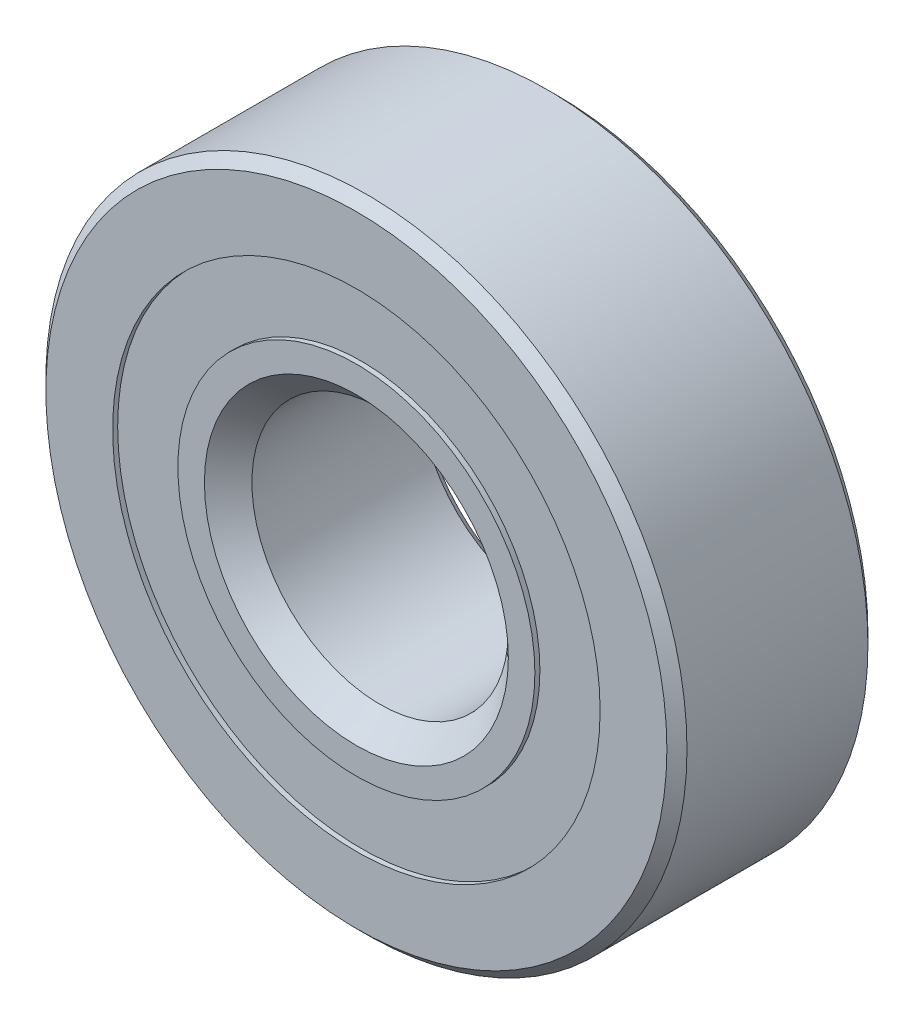
ISO-10303-21;
HEADER;
FILE_DESCRIPTION(('STEP AP214'),'2;1');
FILE_NAME('part.step','',(''),(''),'','','');
FILE_SCHEMA(('AUTOMOTIVE_DESIGN { 1 0 10303 214 1 1 1 1 }'));
ENDSEC;
DATA;
#1=APPLICATION_CONTEXT('core data for automotive mechanical design processes');
#2=APPLICATION_PROTOCOL_DEFINITION('international standard','automotive_design',2000,#1);
#3=PRODUCT_CONTEXT('',#1,'mechanical');
#4=PRODUCT('Part','Part','',(#3));
#5=PRODUCT_RELATED_PRODUCT_CATEGORY('part','',(#4));
#6=PRODUCT_DEFINITION_FORMATION('','',#4);
#7=PRODUCT_DEFINITION_CONTEXT('part definition',#1,'design');
#8=PRODUCT_DEFINITION('design','',#6,#7);
#9=PRODUCT_DEFINITION_SHAPE('','',#8);
#10=(LENGTH_UNIT() NAMED_UNIT(*) SI_UNIT(.MILLI.,.METRE.));
#11=(NAMED_UNIT(*) PLANE_ANGLE_UNIT() SI_UNIT($,.RADIAN.));
#12=(NAMED_UNIT(*) SI_UNIT($,.STERADIAN.) SOLID_ANGLE_UNIT());
#13=UNCERTAINTY_MEASURE_WITH_UNIT(LENGTH_MEASURE(1.E-05),#10,'distance_accuracy_value','');
#14=(GEOMETRIC_REPRESENTATION_CONTEXT(3) GLOBAL_UNCERTAINTY_ASSIGNED_CONTEXT((#13)) GLOBAL_UNIT_ASSIGNED_CONTEXT((#10,
#11,#12)) REPRESENTATION_CONTEXT('',''));
#15=CARTESIAN_POINT('',(0.,0.,0.));
#16=DIRECTION('',(0.,0.,1.));
#17=DIRECTION('',(1.,0.,0.));
#18=AXIS2_PLACEMENT_3D('',#15,#16,#17);
#19=CARTESIAN_POINT('',(0.,0.,2.4892));
#20=DIRECTION('',(0.,0.,1.));
#21=DIRECTION('',(1.,0.,0.));
#22=AXIS2_PLACEMENT_3D('',#19,#20,#21);
#23=CYLINDRICAL_SURFACE('',#22,6.03522142857143);
#24=CARTESIAN_POINT('',(0.,0.,2.4892));
#25=DIRECTION('',(0.,0.,1.));
#26=DIRECTION('',(1.,0.,0.));
#27=AXIS2_PLACEMENT_3D('',#24,#25,#26);
#28=CIRCLE('',#27,6.03522142857143);
#29=CARTESIAN_POINT('',(6.03522142857143,0.,2.4892));
#30=VERTEX_POINT('',#29);
#31=EDGE_CURVE('E151',#30,#30,#28,.T.);
#32=ORIENTED_EDGE('',*,*,#31,.T.);
#33=EDGE_LOOP('',(#32));
#34=FACE_BOUND('',#33,.T.);
#35=CARTESIAN_POINT('',(0.,0.,2.36474));
#36=DIRECTION('',(0.,0.,-1.));
#37=DIRECTION('',(-1.,0.,0.));
#38=AXIS2_PLACEMENT_3D('',#35,#36,#37);
#39=CIRCLE('',#38,6.03522142857143);
#40=CARTESIAN_POINT('',(-6.03522142857143,0.,2.36474));
#41=VERTEX_POINT('',#40);
#42=EDGE_CURVE('E45',#41,#41,#39,.T.);
#43=ORIENTED_EDGE('',*,*,#42,.T.);
#44=EDGE_LOOP('',(#43));
#45=FACE_BOUND('',#44,.T.);
#46=ADVANCED_FACE('F36',(#34,#45),#23,.F.);
#47=CARTESIAN_POINT('',(0.,6.14789916477321,-2.36474));
#48=DIRECTION('',(0.,0.,1.));
#49=DIRECTION('',(1.,0.,0.));
#50=AXIS2_PLACEMENT_3D('',#47,#48,#49);
#51=PLANE('',#50);
#52=CARTESIAN_POINT('',(0.,0.,-2.36474));
#53=DIRECTION('',(0.,0.,1.));
#54=DIRECTION('',(1.,0.,0.));
#55=AXIS2_PLACEMENT_3D('',#52,#53,#54);
#56=CIRCLE('',#55,5.07727857142857);
#57=CARTESIAN_POINT('',(5.07727857142857,0.,-2.36474));
#58=VERTEX_POINT('',#57);
#59=EDGE_CURVE('E58',#58,#58,#56,.T.);
#60=ORIENTED_EDGE('',*,*,#59,.T.);
#61=EDGE_LOOP('',(#60));
#62=FACE_BOUND('',#61,.T.);
#63=CARTESIAN_POINT('',(0.,0.,-2.36474));
#64=DIRECTION('',(0.,0.,1.));
#65=DIRECTION('',(1.,0.,0.));
#66=AXIS2_PLACEMENT_3D('',#63,#64,#65);
#67=CIRCLE('',#66,6.03522142857143);
#68=CARTESIAN_POINT('',(6.03522142857143,0.,-2.36474));
#69=VERTEX_POINT('',#68);
#70=EDGE_CURVE('E63',#69,#69,#67,.T.);
#71=ORIENTED_EDGE('',*,*,#70,.F.);
#72=EDGE_LOOP('',(#71));
#73=FACE_BOUND('',#72,.T.);
#74=ADVANCED_FACE('F123',(#62,#73),#51,.F.);
#75=CARTESIAN_POINT('',(0.,0.,2.4892));
#76=DIRECTION('',(0.,0.,1.));
#77=DIRECTION('',(1.,0.,0.));
#78=AXIS2_PLACEMENT_3D('',#75,#76,#77);
#79=CYLINDRICAL_SURFACE('',#78,5.07727857142857);
#80=CARTESIAN_POINT('',(0.,0.,-2.4892));
#81=DIRECTION('',(0.,0.,1.));
#82=DIRECTION('',(1.,0.,0.));
#83=AXIS2_PLACEMENT_3D('',#80,#81,#82);
#84=CIRCLE('',#83,5.07727857142857);
#85=CARTESIAN_POINT('',(5.07727857142857,0.,-2.4892));
#86=VERTEX_POINT('',#85);
#87=EDGE_CURVE('E188',#86,#86,#84,.T.);
#88=ORIENTED_EDGE('',*,*,#87,.T.);
#89=EDGE_LOOP('',(#88));
#90=FACE_BOUND('',#89,.T.);
#91=ORIENTED_EDGE('',*,*,#59,.F.);
#92=EDGE_LOOP('',(#91));
#93=FACE_BOUND('',#92,.T.);
#94=ADVANCED_FACE('F103',(#90,#93),#79,.T.);
#95=CARTESIAN_POINT('',(0.,0.,2.4892));
#96=DIRECTION('',(0.,0.,1.));
#97=DIRECTION('',(1.,0.,0.));
#98=AXIS2_PLACEMENT_3D('',#95,#96,#97);
#99=CYLINDRICAL_SURFACE('',#98,4.42006562313009);
#100=CARTESIAN_POINT('',(0.,0.,2.4892));
#101=DIRECTION('',(0.,0.,1.));
#102=DIRECTION('',(1.,0.,0.));
#103=AXIS2_PLACEMENT_3D('',#100,#101,#102);
#104=CIRCLE('',#103,4.42006562313009);
#105=CARTESIAN_POINT('',(4.42006562313009,0.,2.4892));
#106=VERTEX_POINT('',#105);
#107=EDGE_CURVE('E171',#106,#106,#104,.T.);
#108=ORIENTED_EDGE('',*,*,#107,.F.);
#109=EDGE_LOOP('',(#108));
#110=FACE_BOUND('',#109,.T.);
#111=CARTESIAN_POINT('',(0.,0.,2.36474));
#112=DIRECTION('',(0.,0.,1.));
#113=DIRECTION('',(1.,0.,0.));
#114=AXIS2_PLACEMENT_3D('',#111,#112,#113);
#115=CIRCLE('',#114,4.42006562313009);
#116=CARTESIAN_POINT('',(4.42006562313009,0.,2.36474));
#117=VERTEX_POINT('',#116);
#118=EDGE_CURVE('E10',#117,#117,#115,.T.);
#119=ORIENTED_EDGE('',*,*,#118,.T.);
#120=EDGE_LOOP('',(#119));
#121=FACE_BOUND('',#120,.T.);
#122=ADVANCED_FACE('F113',(#110,#121),#99,.T.);
#123=CARTESIAN_POINT('',(0.,3.42392,-2.4892));
#124=DIRECTION('',(0.,0.,1.));
#125=DIRECTION('',(1.,0.,0.));
#126=AXIS2_PLACEMENT_3D('',#123,#124,#125);
#127=PLANE('',#126);
#128=ORIENTED_EDGE('',*,*,#87,.F.);
#129=EDGE_LOOP('',(#128));
#130=FACE_BOUND('',#129,.T.);
#131=CARTESIAN_POINT('',(0.,0.,-2.4892));
#132=DIRECTION('',(0.,0.,1.));
#133=DIRECTION('',(1.,0.,0.));
#134=AXIS2_PLACEMENT_3D('',#131,#132,#133);
#135=CIRCLE('',#134,3.42392);
#136=CARTESIAN_POINT('',(3.42392,0.,-2.4892));
#137=VERTEX_POINT('',#136);
#138=EDGE_CURVE('E185',#137,#137,#135,.T.);
#139=ORIENTED_EDGE('',*,*,#138,.T.);
#140=EDGE_LOOP('',(#139));
#141=FACE_BOUND('',#140,.T.);
#142=ADVANCED_FACE('F115',(#130,#141),#127,.F.);
#143=CARTESIAN_POINT('',(0.,0.,-2.24028));
#144=DIRECTION('',(0.,0.,-1.));
#145=DIRECTION('',(-1.,0.,0.));
#146=AXIS2_PLACEMENT_3D('',#143,#144,#145);
#147=CONICAL_SURFACE('',#146,3.175,0.785398163397448);
#148=ORIENTED_EDGE('',*,*,#138,.F.);
#149=EDGE_LOOP('',(#148));
#150=FACE_BOUND('',#149,.T.);
#151=CARTESIAN_POINT('',(0.,0.,-2.24028));
#152=DIRECTION('',(0.,0.,1.));
#153=DIRECTION('',(1.,0.,0.));
#154=AXIS2_PLACEMENT_3D('',#151,#152,#153);
#155=CIRCLE('',#154,3.175);
#156=CARTESIAN_POINT('',(3.175,0.,-2.24028));
#157=VERTEX_POINT('',#156);
#158=EDGE_CURVE('E182',#157,#157,#155,.T.);
#159=ORIENTED_EDGE('',*,*,#158,.T.);
#160=EDGE_LOOP('',(#159));
#161=FACE_BOUND('',#160,.T.);
#162=ADVANCED_FACE('F121',(#150,#161),#147,.F.);
#163=CARTESIAN_POINT('',(0.,0.,2.4892));
#164=DIRECTION('',(0.,0.,1.));
#165=DIRECTION('',(1.,0.,0.));
#166=AXIS2_PLACEMENT_3D('',#163,#164,#165);
#167=CYLINDRICAL_SURFACE('',#166,3.175);
#168=ORIENTED_EDGE('',*,*,#158,.F.);
#169=EDGE_LOOP('',(#168));
#170=FACE_BOUND('',#169,.T.);
#171=CARTESIAN_POINT('',(0.,0.,1.9013473251684));
#172=DIRECTION('',(0.,0.,1.));
#173=DIRECTION('',(1.,0.,0.));
#174=AXIS2_PLACEMENT_3D('',#171,#172,#173);
#175=CIRCLE('',#174,3.175);
#176=CARTESIAN_POINT('',(3.175,0.,1.9013473251684));
#177=VERTEX_POINT('',#176);
#178=EDGE_CURVE('E179',#177,#177,#175,.T.);
#179=ORIENTED_EDGE('',*,*,#178,.T.);
#180=EDGE_LOOP('',(#179));
#181=FACE_BOUND('',#180,.T.);
#182=ADVANCED_FACE('F260',(#170,#181),#167,.F.);
#183=CARTESIAN_POINT('',(0.,0.,2.4892));
#184=DIRECTION('',(0.,0.,1.));
#185=DIRECTION('',(1.,0.,0.));
#186=AXIS2_PLACEMENT_3D('',#183,#184,#185);
#187=CONICAL_SURFACE('',#186,3.7628526748316,0.785398163397449);
#188=ORIENTED_EDGE('',*,*,#178,.F.);
#189=EDGE_LOOP('',(#188));
#190=FACE_BOUND('',#189,.T.);
#191=CARTESIAN_POINT('',(0.,0.,2.4892));
#192=DIRECTION('',(0.,0.,1.));
#193=DIRECTION('',(1.,0.,0.));
#194=AXIS2_PLACEMENT_3D('',#191,#192,#193);
#195=CIRCLE('',#194,3.7628526748316);
#196=CARTESIAN_POINT('',(3.7628526748316,0.,2.4892));
#197=VERTEX_POINT('',#196);
#198=EDGE_CURVE('E176',#197,#197,#195,.T.);
#199=ORIENTED_EDGE('',*,*,#198,.T.);
#200=EDGE_LOOP('',(#199));
#201=FACE_BOUND('',#200,.T.);
#202=ADVANCED_FACE('F233',(#190,#201),#187,.F.);
#203=CARTESIAN_POINT('',(0.,4.42006562313009,2.4892));
#204=DIRECTION('',(0.,0.,-1.));
#205=DIRECTION('',(-1.,0.,0.));
#206=AXIS2_PLACEMENT_3D('',#203,#204,#205);
#207=PLANE('',#206);
#208=ORIENTED_EDGE('',*,*,#198,.F.);
#209=EDGE_LOOP('',(#208));
#210=FACE_BOUND('',#209,.T.);
#211=ORIENTED_EDGE('',*,*,#107,.T.);
#212=EDGE_LOOP('',(#211));
#213=FACE_BOUND('',#212,.T.);
#214=ADVANCED_FACE('F224',(#210,#213),#207,.F.);
#215=CARTESIAN_POINT('',(0.,0.,2.4892));
#216=DIRECTION('',(0.,0.,1.));
#217=DIRECTION('',(1.,0.,0.));
#218=AXIS2_PLACEMENT_3D('',#215,#216,#217);
#219=CYLINDRICAL_SURFACE('',#218,6.03522142857143);
#220=CARTESIAN_POINT('',(0.,0.,-2.4892));
#221=DIRECTION('',(0.,0.,1.));
#222=DIRECTION('',(1.,0.,0.));
#223=AXIS2_PLACEMENT_3D('',#220,#221,#222);
#224=CIRCLE('',#223,6.03522142857143);
#225=CARTESIAN_POINT('',(6.03522142857143,0.,-2.4892));
#226=VERTEX_POINT('',#225);
#227=EDGE_CURVE('E154',#226,#226,#224,.T.);
#228=ORIENTED_EDGE('',*,*,#227,.F.);
#229=EDGE_LOOP('',(#228));
#230=FACE_BOUND('',#229,.T.);
#231=ORIENTED_EDGE('',*,*,#70,.T.);
#232=EDGE_LOOP('',(#231));
#233=FACE_BOUND('',#232,.T.);
#234=ADVANCED_FACE('F218',(#230,#233),#219,.F.);
#235=CARTESIAN_POINT('',(0.,0.,2.24028));
#236=DIRECTION('',(0.,0.,-1.));
#237=DIRECTION('',(-1.,0.,0.));
#238=AXIS2_PLACEMENT_3D('',#235,#236,#237);
#239=CONICAL_SURFACE('',#238,7.9375,0.785398163397447);
#240=CARTESIAN_POINT('',(0.,0.,2.4892));
#241=DIRECTION('',(0.,0.,1.));
#242=DIRECTION('',(1.,0.,0.));
#243=AXIS2_PLACEMENT_3D('',#240,#241,#242);
#244=CIRCLE('',#243,7.68858);
#245=CARTESIAN_POINT('',(7.68858,0.,2.4892));
#246=VERTEX_POINT('',#245);
#247=EDGE_CURVE('E156',#246,#246,#244,.T.);
#248=ORIENTED_EDGE('',*,*,#247,.F.);
#249=EDGE_LOOP('',(#248));
#250=FACE_BOUND('',#249,.T.);
#251=CARTESIAN_POINT('',(0.,0.,2.24028));
#252=DIRECTION('',(0.,0.,1.));
#253=DIRECTION('',(1.,0.,0.));
#254=AXIS2_PLACEMENT_3D('',#251,#252,#253);
#255=CIRCLE('',#254,7.9375);
#256=CARTESIAN_POINT('',(7.9375,0.,2.24028));
#257=VERTEX_POINT('',#256);
#258=EDGE_CURVE('E168',#257,#257,#255,.T.);
#259=ORIENTED_EDGE('',*,*,#258,.T.);
#260=EDGE_LOOP('',(#259));
#261=FACE_BOUND('',#260,.T.);
#262=ADVANCED_FACE('F223',(#250,#261),#239,.T.);
#263=CARTESIAN_POINT('',(0.,0.,2.4892));
#264=DIRECTION('',(0.,0.,1.));
#265=DIRECTION('',(1.,0.,0.));
#266=AXIS2_PLACEMENT_3D('',#263,#264,#265);
#267=CYLINDRICAL_SURFACE('',#266,7.9375);
#268=ORIENTED_EDGE('',*,*,#258,.F.);
#269=EDGE_LOOP('',(#268));
#270=FACE_BOUND('',#269,.T.);
#271=CARTESIAN_POINT('',(0.,0.,-2.24028));
#272=DIRECTION('',(0.,0.,1.));
#273=DIRECTION('',(1.,0.,0.));
#274=AXIS2_PLACEMENT_3D('',#271,#272,#273);
#275=CIRCLE('',#274,7.9375);
#276=CARTESIAN_POINT('',(7.9375,0.,-2.24028));
#277=VERTEX_POINT('',#276);
#278=EDGE_CURVE('E165',#277,#277,#275,.T.);
#279=ORIENTED_EDGE('',*,*,#278,.T.);
#280=EDGE_LOOP('',(#279));
#281=FACE_BOUND('',#280,.T.);
#282=ADVANCED_FACE('F230',(#270,#281),#267,.T.);
#283=CARTESIAN_POINT('',(0.,0.,-2.4892));
#284=DIRECTION('',(0.,0.,1.));
#285=DIRECTION('',(1.,0.,0.));
#286=AXIS2_PLACEMENT_3D('',#283,#284,#285);
#287=CONICAL_SURFACE('',#286,7.68858,0.785398163397447);
#288=ORIENTED_EDGE('',*,*,#278,.F.);
#289=EDGE_LOOP('',(#288));
#290=FACE_BOUND('',#289,.T.);
#291=CARTESIAN_POINT('',(0.,0.,-2.4892));
#292=DIRECTION('',(0.,0.,1.));
#293=DIRECTION('',(1.,0.,0.));
#294=AXIS2_PLACEMENT_3D('',#291,#292,#293);
#295=CIRCLE('',#294,7.68858);
#296=CARTESIAN_POINT('',(7.68858,0.,-2.4892));
#297=VERTEX_POINT('',#296);
#298=EDGE_CURVE('E162',#297,#297,#295,.T.);
#299=ORIENTED_EDGE('',*,*,#298,.T.);
#300=EDGE_LOOP('',(#299));
#301=FACE_BOUND('',#300,.T.);
#302=ADVANCED_FACE('F244',(#290,#301),#287,.T.);
#303=CARTESIAN_POINT('',(0.,7.68858,-2.4892));
#304=DIRECTION('',(0.,0.,1.));
#305=DIRECTION('',(1.,0.,0.));
#306=AXIS2_PLACEMENT_3D('',#303,#304,#305);
#307=PLANE('',#306);
#308=ORIENTED_EDGE('',*,*,#298,.F.);
#309=EDGE_LOOP('',(#308));
#310=FACE_BOUND('',#309,.T.);
#311=ORIENTED_EDGE('',*,*,#227,.T.);
#312=EDGE_LOOP('',(#311));
#313=FACE_BOUND('',#312,.T.);
#314=ADVANCED_FACE('F241',(#310,#313),#307,.F.);
#315=CARTESIAN_POINT('',(0.,7.68858,2.4892));
#316=DIRECTION('',(0.,0.,-1.));
#317=DIRECTION('',(-1.,0.,0.));
#318=AXIS2_PLACEMENT_3D('',#315,#316,#317);
#319=PLANE('',#318);
#320=ORIENTED_EDGE('',*,*,#31,.F.);
#321=EDGE_LOOP('',(#320));
#322=FACE_BOUND('',#321,.T.);
#323=ORIENTED_EDGE('',*,*,#247,.T.);
#324=EDGE_LOOP('',(#323));
#325=FACE_BOUND('',#324,.T.);
#326=ADVANCED_FACE('F243',(#322,#325),#319,.F.);
#327=CARTESIAN_POINT('',(0.,6.14789916477321,2.36474));
#328=DIRECTION('',(0.,0.,-1.));
#329=DIRECTION('',(-1.,0.,0.));
#330=AXIS2_PLACEMENT_3D('',#327,#328,#329);
#331=PLANE('',#330);
#332=ORIENTED_EDGE('',*,*,#42,.F.);
#333=EDGE_LOOP('',(#332));
#334=FACE_BOUND('',#333,.T.);
#335=ORIENTED_EDGE('',*,*,#118,.F.);
#336=EDGE_LOOP('',(#335));
#337=FACE_BOUND('',#336,.T.);
#338=ADVANCED_FACE('F38',(#334,#337),#331,.F.);
#339=CLOSED_SHELL('',(#46,#74,#94,#122,#142,#162,#182,#202,#214,#234,#262,#282,#302,#314,#326,#338));
#340=CARTESIAN_POINT('',(0.,0.,0.));
#341=DIRECTION('',(0.,0.,1.));
#342=DIRECTION('',(1.,0.,0.));
#343=AXIS2_PLACEMENT_3D('',#340,#341,#342);
#344=TOROIDAL_SURFACE('',#343,5.55625,1.20554465033679);
#345=CARTESIAN_POINT('',(0.,0.,0.));
#346=DIRECTION('',(0.,0.,1.));
#347=DIRECTION('',(1.,0.,0.));
#348=AXIS2_PLACEMENT_3D('',#345,#346,#347);
#349=CIRCLE('',#348,4.35070534966321);
#350=CARTESIAN_POINT('',(4.35070534966321,0.,0.));
#351=VERTEX_POINT('',#350);
#352=EDGE_CURVE('E194',#351,#351,#349,.T.);
#353=ORIENTED_EDGE('',*,*,#352,.F.);
#354=EDGE_LOOP('',(#353));
#355=FACE_BOUND('',#354,.T.);
#356=CARTESIAN_POINT('',(0.,0.,-1.10631111111111));
#357=DIRECTION('',(0.,0.,1.));
#358=DIRECTION('',(1.,0.,0.));
#359=AXIS2_PLACEMENT_3D('',#356,#357,#358);
#360=CIRCLE('',#359,5.07727857142857);
#361=CARTESIAN_POINT('',(5.07727857142857,0.,-1.10631111111111));
#362=VERTEX_POINT('',#361);
#363=EDGE_CURVE('E191',#362,#362,#360,.T.);
#364=ORIENTED_EDGE('',*,*,#363,.T.);
#365=EDGE_LOOP('',(#364));
#366=FACE_BOUND('',#365,.T.);
#367=ADVANCED_FACE('F88',(#355,#366),#344,.F.);
#368=CARTESIAN_POINT('',(0.,3.7628526748316,0.));
#369=DIRECTION('',(0.,0.,-1.));
#370=DIRECTION('',(-1.,0.,0.));
#371=AXIS2_PLACEMENT_3D('',#368,#369,#370);
#372=PLANE('',#371);
#373=CARTESIAN_POINT('',(0.,0.,0.));
#374=DIRECTION('',(0.,0.,1.));
#375=DIRECTION('',(1.,0.,0.));
#376=AXIS2_PLACEMENT_3D('',#373,#374,#375);
#377=CIRCLE('',#376,3.7628526748316);
#378=CARTESIAN_POINT('',(3.7628526748316,0.,0.));
#379=VERTEX_POINT('',#378);
#380=EDGE_CURVE('E196',#379,#379,#377,.T.);
#381=ORIENTED_EDGE('',*,*,#380,.F.);
#382=EDGE_LOOP('',(#381));
#383=FACE_BOUND('',#382,.T.);
#384=ORIENTED_EDGE('',*,*,#352,.T.);
#385=EDGE_LOOP('',(#384));
#386=FACE_BOUND('',#385,.T.);
#387=ADVANCED_FACE('F90',(#383,#386),#372,.F.);
#388=CARTESIAN_POINT('',(0.,0.,2.4892));
#389=DIRECTION('',(0.,0.,1.));
#390=DIRECTION('',(1.,0.,0.));
#391=AXIS2_PLACEMENT_3D('',#388,#389,#390);
#392=CYLINDRICAL_SURFACE('',#391,3.7628526748316);
#393=CARTESIAN_POINT('',(0.,0.,1.83198705170152));
#394=DIRECTION('',(0.,0.,1.));
#395=DIRECTION('',(1.,0.,0.));
#396=AXIS2_PLACEMENT_3D('',#393,#394,#395);
#397=CIRCLE('',#396,3.7628526748316);
#398=CARTESIAN_POINT('',(3.7628526748316,0.,1.83198705170152));
#399=VERTEX_POINT('',#398);
#400=EDGE_CURVE('E53',#399,#399,#397,.T.);
#401=ORIENTED_EDGE('',*,*,#400,.F.);
#402=EDGE_LOOP('',(#401));
#403=FACE_BOUND('',#402,.T.);
#404=ORIENTED_EDGE('',*,*,#380,.T.);
#405=EDGE_LOOP('',(#404));
#406=FACE_BOUND('',#405,.T.);
#407=ADVANCED_FACE('F97',(#403,#406),#392,.T.);
#408=CARTESIAN_POINT('',(0.,0.,1.83198705170152));
#409=DIRECTION('',(0.,0.,1.));
#410=DIRECTION('',(1.,0.,0.));
#411=AXIS2_PLACEMENT_3D('',#408,#409,#410);
#412=CONICAL_SURFACE('',#411,3.7628526748316,0.78539816339745);
#413=ORIENTED_EDGE('',*,*,#400,.T.);
#414=EDGE_LOOP('',(#413));
#415=FACE_BOUND('',#414,.T.);
#416=CARTESIAN_POINT('',(0.,0.,2.32483473021024));
#417=DIRECTION('',(0.,0.,1.));
#418=DIRECTION('',(1.,0.,0.));
#419=AXIS2_PLACEMENT_3D('',#416,#417,#418);
#420=CIRCLE('',#419,4.25570035334033);
#421=CARTESIAN_POINT('',(4.25570035334033,0.,2.32483473021024));
#422=VERTEX_POINT('',#421);
#423=EDGE_CURVE('E40',#422,#422,#420,.F.);
#424=ORIENTED_EDGE('',*,*,#423,.T.);
#425=EDGE_LOOP('',(#424));
#426=FACE_BOUND('',#425,.T.);
#427=ADVANCED_FACE('F74',(#415,#426),#412,.T.);
#428=ORIENTED_EDGE('',*,*,#363,.F.);
#429=EDGE_LOOP('',(#428));
#430=FACE_BOUND('',#429,.T.);
#431=CARTESIAN_POINT('',(0.,0.,-1.2055446503368));
#432=DIRECTION('',(0.,0.,-1.));
#433=DIRECTION('',(-1.,0.,0.));
#434=AXIS2_PLACEMENT_3D('',#431,#432,#433);
#435=CIRCLE('',#434,5.07727857142857);
#436=CARTESIAN_POINT('',(-5.07727857142857,0.,-1.2055446503368));
#437=VERTEX_POINT('',#436);
#438=EDGE_CURVE('E55',#437,#437,#435,.T.);
#439=ORIENTED_EDGE('',*,*,#438,.F.);
#440=EDGE_LOOP('',(#439));
#441=FACE_BOUND('',#440,.T.);
#442=ADVANCED_FACE('F111',(#430,#441),#79,.T.);
#443=CARTESIAN_POINT('',(0.,6.14789916477321,-1.2055446503368));
#444=DIRECTION('',(0.,0.,-1.));
#445=DIRECTION('',(-1.,0.,0.));
#446=AXIS2_PLACEMENT_3D('',#443,#444,#445);
#447=PLANE('',#446);
#448=ORIENTED_EDGE('',*,*,#438,.T.);
#449=EDGE_LOOP('',(#448));
#450=FACE_BOUND('',#449,.T.);
#451=CARTESIAN_POINT('',(0.,0.,-1.2055446503368));
#452=DIRECTION('',(0.,0.,-1.));
#453=DIRECTION('',(-1.,0.,0.));
#454=AXIS2_PLACEMENT_3D('',#451,#452,#453);
#455=CIRCLE('',#454,6.03522142857143);
#456=CARTESIAN_POINT('',(-6.03522142857143,0.,-1.2055446503368));
#457=VERTEX_POINT('',#456);
#458=EDGE_CURVE('E61',#457,#457,#455,.T.);
#459=ORIENTED_EDGE('',*,*,#458,.F.);
#460=EDGE_LOOP('',(#459));
#461=FACE_BOUND('',#460,.T.);
#462=ADVANCED_FACE('F207',(#450,#461),#447,.F.);
#463=CARTESIAN_POINT('',(0.,0.,-1.10631111111111));
#464=DIRECTION('',(0.,0.,1.));
#465=DIRECTION('',(1.,0.,0.));
#466=AXIS2_PLACEMENT_3D('',#463,#464,#465);
#467=CIRCLE('',#466,6.03522142857143);
#468=CARTESIAN_POINT('',(6.03522142857143,0.,-1.10631111111111));
#469=VERTEX_POINT('',#468);
#470=EDGE_CURVE('E150',#469,#469,#467,.T.);
#471=ORIENTED_EDGE('',*,*,#470,.T.);
#472=EDGE_LOOP('',(#471));
#473=FACE_BOUND('',#472,.T.);
#474=ORIENTED_EDGE('',*,*,#458,.T.);
#475=EDGE_LOOP('',(#474));
#476=FACE_BOUND('',#475,.T.);
#477=ADVANCED_FACE('F144',(#473,#476),#219,.F.);
#478=CARTESIAN_POINT('',(0.,0.,0.));
#479=DIRECTION('',(0.,0.,1.));
#480=DIRECTION('',(1.,0.,0.));
#481=AXIS2_PLACEMENT_3D('',#478,#479,#480);
#482=TOROIDAL_SURFACE('',#481,5.55625,1.20554465033679);
#483=ORIENTED_EDGE('',*,*,#470,.F.);
#484=EDGE_LOOP('',(#483));
#485=FACE_BOUND('',#484,.T.);
#486=CARTESIAN_POINT('',(0.,0.,1.10631111111111));
#487=DIRECTION('',(0.,0.,1.));
#488=DIRECTION('',(1.,0.,0.));
#489=AXIS2_PLACEMENT_3D('',#486,#487,#488);
#490=CIRCLE('',#489,6.03522142857143);
#491=CARTESIAN_POINT('',(6.03522142857143,0.,1.10631111111111));
#492=VERTEX_POINT('',#491);
#493=EDGE_CURVE('E148',#492,#492,#490,.T.);
#494=ORIENTED_EDGE('',*,*,#493,.T.);
#495=EDGE_LOOP('',(#494));
#496=FACE_BOUND('',#495,.T.);
#497=ADVANCED_FACE('F139',(#485,#496),#482,.F.);
#498=ORIENTED_EDGE('',*,*,#493,.F.);
#499=EDGE_LOOP('',(#498));
#500=FACE_BOUND('',#499,.T.);
#501=CARTESIAN_POINT('',(0.,0.,1.20554465033679));
#502=DIRECTION('',(0.,0.,1.));
#503=DIRECTION('',(1.,0.,0.));
#504=AXIS2_PLACEMENT_3D('',#501,#502,#503);
#505=CIRCLE('',#504,6.03522142857143);
#506=CARTESIAN_POINT('',(6.03522142857143,0.,1.20554465033679));
#507=VERTEX_POINT('',#506);
#508=EDGE_CURVE('E67',#507,#507,#505,.T.);
#509=ORIENTED_EDGE('',*,*,#508,.T.);
#510=EDGE_LOOP('',(#509));
#511=FACE_BOUND('',#510,.T.);
#512=ADVANCED_FACE('F84',(#500,#511),#23,.F.);
#513=CARTESIAN_POINT('',(0.,6.14789916477321,1.20554465033679));
#514=DIRECTION('',(0.,0.,1.));
#515=DIRECTION('',(1.,0.,0.));
#516=AXIS2_PLACEMENT_3D('',#513,#514,#515);
#517=PLANE('',#516);
#518=CARTESIAN_POINT('',(0.,0.,1.20554465033679));
#519=DIRECTION('',(0.,0.,1.));
#520=DIRECTION('',(1.,0.,0.));
#521=AXIS2_PLACEMENT_3D('',#518,#519,#520);
#522=CIRCLE('',#521,4.25570035334033);
#523=CARTESIAN_POINT('',(4.25570035334033,0.,1.20554465033679));
#524=VERTEX_POINT('',#523);
#525=EDGE_CURVE('E65',#524,#524,#522,.T.);
#526=ORIENTED_EDGE('',*,*,#525,.T.);
#527=EDGE_LOOP('',(#526));
#528=FACE_BOUND('',#527,.T.);
#529=ORIENTED_EDGE('',*,*,#508,.F.);
#530=EDGE_LOOP('',(#529));
#531=FACE_BOUND('',#530,.T.);
#532=ADVANCED_FACE('F78',(#528,#531),#517,.F.);
#533=CARTESIAN_POINT('',(0.,0.,2.4892));
#534=DIRECTION('',(0.,0.,1.));
#535=DIRECTION('',(1.,0.,0.));
#536=AXIS2_PLACEMENT_3D('',#533,#534,#535);
#537=CYLINDRICAL_SURFACE('',#536,4.25570035334033);
#538=ORIENTED_EDGE('',*,*,#525,.F.);
#539=EDGE_LOOP('',(#538));
#540=FACE_BOUND('',#539,.T.);
#541=ORIENTED_EDGE('',*,*,#423,.F.);
#542=EDGE_LOOP('',(#541));
#543=FACE_BOUND('',#542,.T.);
#544=ADVANCED_FACE('F76',(#540,#543),#537,.F.);
#545=CLOSED_SHELL('',(#367,#387,#407,#427,#442,#462,#477,#497,#512,#532,#544));
#546=ORIENTED_CLOSED_SHELL('',*,#545,.T.);
#547=BREP_WITH_VOIDS('B2',#339,(#546));
#548=ADVANCED_BREP_SHAPE_REPRESENTATION('',(#18,#547),#14);
#549=SHAPE_DEFINITION_REPRESENTATION(#9,#548);
ENDSEC;
END-ISO-10303-21;
